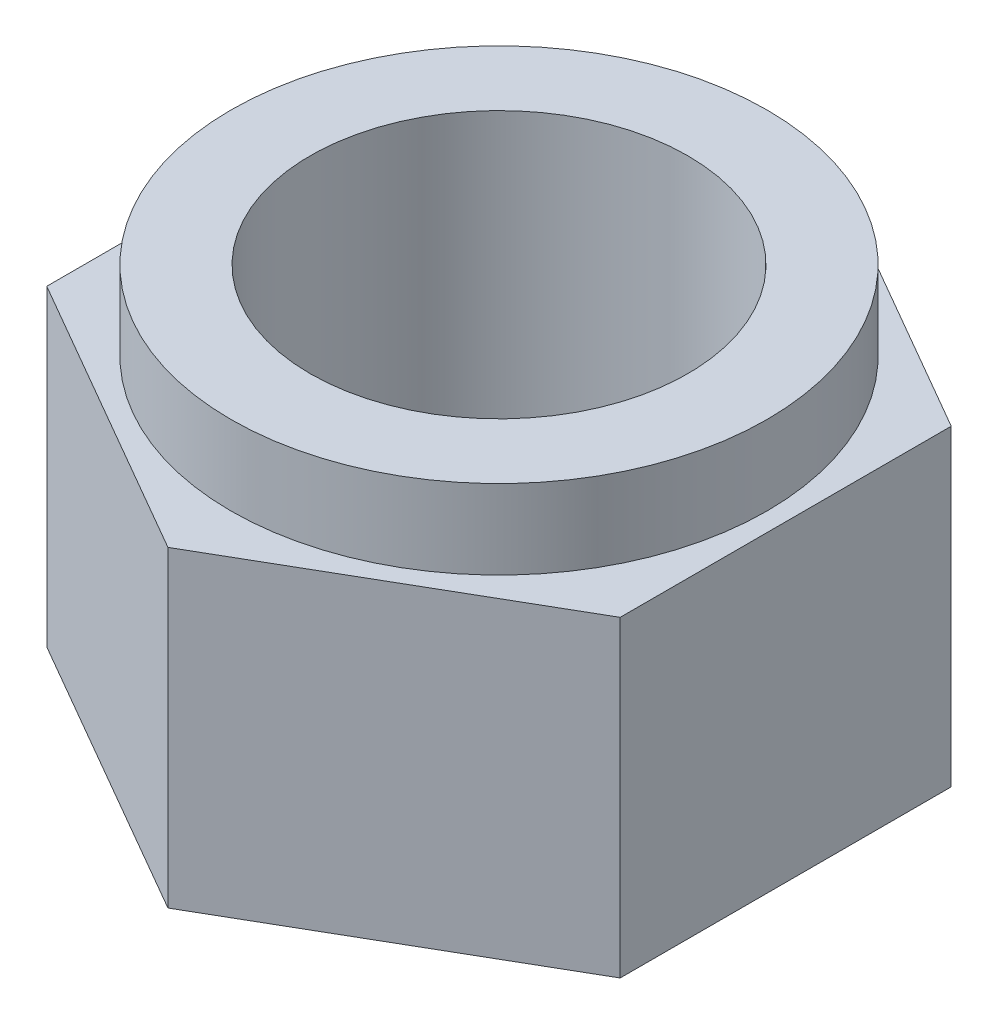
ISO-10303-21;
HEADER;
FILE_DESCRIPTION(('STEP AP214'),'2;1');
FILE_NAME('part.step','',(''),(''),'','','');
FILE_SCHEMA(('AUTOMOTIVE_DESIGN { 1 0 10303 214 1 1 1 1 }'));
ENDSEC;
DATA;
#1=APPLICATION_CONTEXT('core data for automotive mechanical design processes');
#2=APPLICATION_PROTOCOL_DEFINITION('international standard','automotive_design',2000,#1);
#3=PRODUCT_CONTEXT('',#1,'mechanical');
#4=PRODUCT('Part','Part','',(#3));
#5=PRODUCT_RELATED_PRODUCT_CATEGORY('part','',(#4));
#6=PRODUCT_DEFINITION_FORMATION('','',#4);
#7=PRODUCT_DEFINITION_CONTEXT('part definition',#1,'design');
#8=PRODUCT_DEFINITION('design','',#6,#7);
#9=PRODUCT_DEFINITION_SHAPE('','',#8);
#10=(LENGTH_UNIT() NAMED_UNIT(*) SI_UNIT(.MILLI.,.METRE.));
#11=(NAMED_UNIT(*) PLANE_ANGLE_UNIT() SI_UNIT($,.RADIAN.));
#12=(NAMED_UNIT(*) SI_UNIT($,.STERADIAN.) SOLID_ANGLE_UNIT());
#13=UNCERTAINTY_MEASURE_WITH_UNIT(LENGTH_MEASURE(1.E-05),#10,'distance_accuracy_value','');
#14=(GEOMETRIC_REPRESENTATION_CONTEXT(3) GLOBAL_UNCERTAINTY_ASSIGNED_CONTEXT((#13)) GLOBAL_UNIT_ASSIGNED_CONTEXT((#10,
#11,#12)) REPRESENTATION_CONTEXT('',''));
#15=CARTESIAN_POINT('',(0.,0.,0.));
#16=DIRECTION('',(0.,0.,1.));
#17=DIRECTION('',(1.,0.,0.));
#18=AXIS2_PLACEMENT_3D('',#15,#16,#17);
#19=CARTESIAN_POINT('',(0.,6.7,0.));
#20=DIRECTION('',(0.,1.,0.));
#21=DIRECTION('',(0.,0.,1.));
#22=AXIS2_PLACEMENT_3D('',#19,#20,#21);
#23=PLANE('',#22);
#24=CARTESIAN_POINT('',(-2.98261802575105,6.7,-3.02221030042916));
#25=DIRECTION('',(0.,1.,0.));
#26=DIRECTION('',(0.,0.,1.));
#27=AXIS2_PLACEMENT_3D('',#24,#25,#26);
#28=CIRCLE('',#27,5.75);
#29=CARTESIAN_POINT('',(-2.98261802575105,6.7,2.72778969957084));
#30=VERTEX_POINT('',#29);
#31=EDGE_CURVE('E11',#30,#30,#28,.T.);
#32=ORIENTED_EDGE('',*,*,#31,.F.);
#33=EDGE_LOOP('',(#32));
#34=FACE_BOUND('',#33,.T.);
#35=DIRECTION('',(0.866025403784438,0.,-0.5));
#36=VECTOR('',#35,1.);
#37=CARTESIAN_POINT('',(-2.98261802575105,6.7,4.07919801060324));
#38=LINE('',#37,#36);
#39=CARTESIAN_POINT('',(-2.98261802575105,6.7,4.07919801060324));
#40=VERTEX_POINT('',#39);
#41=CARTESIAN_POINT('',(3.16738197424895,6.7,0.528493855087039));
#42=VERTEX_POINT('',#41);
#43=EDGE_CURVE('E130',#40,#42,#38,.T.);
#44=ORIENTED_EDGE('',*,*,#43,.T.);
#45=DIRECTION('',(0.,0.,-1.));
#46=VECTOR('',#45,1.);
#47=CARTESIAN_POINT('',(3.16738197424895,6.7,0.528493855087039));
#48=LINE('',#47,#46);
#49=CARTESIAN_POINT('',(3.16738197424895,6.7,-6.57291445594536));
#50=VERTEX_POINT('',#49);
#51=EDGE_CURVE('E89',#42,#50,#48,.T.);
#52=ORIENTED_EDGE('',*,*,#51,.T.);
#53=DIRECTION('',(-0.866025403784439,0.,-0.5));
#54=VECTOR('',#53,1.);
#55=CARTESIAN_POINT('',(3.16738197424895,6.7,-6.57291445594536));
#56=LINE('',#55,#54);
#57=CARTESIAN_POINT('',(-2.98261802575105,6.7,-10.1236186114616));
#58=VERTEX_POINT('',#57);
#59=EDGE_CURVE('E101',#50,#58,#56,.T.);
#60=ORIENTED_EDGE('',*,*,#59,.T.);
#61=DIRECTION('',(-0.866025403784438,0.,0.5));
#62=VECTOR('',#61,1.);
#63=CARTESIAN_POINT('',(-2.98261802575105,6.7,-10.1236186114616));
#64=LINE('',#63,#62);
#65=CARTESIAN_POINT('',(-9.13261802575105,6.7,-6.57291445594536));
#66=VERTEX_POINT('',#65);
#67=EDGE_CURVE('E96',#58,#66,#64,.T.);
#68=ORIENTED_EDGE('',*,*,#67,.T.);
#69=DIRECTION('',(0.,0.,1.));
#70=VECTOR('',#69,1.);
#71=CARTESIAN_POINT('',(-9.13261802575105,6.7,-6.57291445594536));
#72=LINE('',#71,#70);
#73=CARTESIAN_POINT('',(-9.13261802575105,6.7,0.528493855087037));
#74=VERTEX_POINT('',#73);
#75=EDGE_CURVE('E99',#66,#74,#72,.T.);
#76=ORIENTED_EDGE('',*,*,#75,.T.);
#77=DIRECTION('',(0.866025403784439,0.,0.5));
#78=VECTOR('',#77,1.);
#79=CARTESIAN_POINT('',(-9.13261802575105,6.7,0.528493855087037));
#80=LINE('',#79,#78);
#81=EDGE_CURVE('E51',#74,#40,#80,.T.);
#82=ORIENTED_EDGE('',*,*,#81,.T.);
#83=EDGE_LOOP('',(#44,#52,#60,#68,#76,#82));
#84=FACE_BOUND('',#83,.T.);
#85=ADVANCED_FACE('F33',(#34,#84),#23,.T.);
#86=CARTESIAN_POINT('',(0.,0.,0.));
#87=DIRECTION('',(0.,1.,0.));
#88=DIRECTION('',(0.,0.,1.));
#89=AXIS2_PLACEMENT_3D('',#86,#87,#88);
#90=PLANE('',#89);
#91=DIRECTION('',(0.866025403784438,0.,-0.5));
#92=VECTOR('',#91,1.);
#93=CARTESIAN_POINT('',(-2.98261802575105,0.,4.07919801060324));
#94=LINE('',#93,#92);
#95=CARTESIAN_POINT('',(-2.98261802575105,0.,4.07919801060324));
#96=VERTEX_POINT('',#95);
#97=CARTESIAN_POINT('',(3.16738197424895,0.,0.528493855087039));
#98=VERTEX_POINT('',#97);
#99=EDGE_CURVE('E119',#96,#98,#94,.T.);
#100=ORIENTED_EDGE('',*,*,#99,.F.);
#101=DIRECTION('',(0.866025403784439,0.,0.5));
#102=VECTOR('',#101,1.);
#103=CARTESIAN_POINT('',(-9.13261802575105,0.,0.528493855087037));
#104=LINE('',#103,#102);
#105=CARTESIAN_POINT('',(-9.13261802575105,0.,0.528493855087037));
#106=VERTEX_POINT('',#105);
#107=EDGE_CURVE('E80',#106,#96,#104,.T.);
#108=ORIENTED_EDGE('',*,*,#107,.F.);
#109=DIRECTION('',(0.,0.,1.));
#110=VECTOR('',#109,1.);
#111=CARTESIAN_POINT('',(-9.13261802575105,0.,-6.57291445594536));
#112=LINE('',#111,#110);
#113=CARTESIAN_POINT('',(-9.13261802575105,0.,-6.57291445594536));
#114=VERTEX_POINT('',#113);
#115=EDGE_CURVE('E74',#114,#106,#112,.T.);
#116=ORIENTED_EDGE('',*,*,#115,.F.);
#117=DIRECTION('',(-0.866025403784438,0.,0.5));
#118=VECTOR('',#117,1.);
#119=CARTESIAN_POINT('',(-2.98261802575105,0.,-10.1236186114616));
#120=LINE('',#119,#118);
#121=CARTESIAN_POINT('',(-2.98261802575105,0.,-10.1236186114616));
#122=VERTEX_POINT('',#121);
#123=EDGE_CURVE('E109',#122,#114,#120,.T.);
#124=ORIENTED_EDGE('',*,*,#123,.F.);
#125=DIRECTION('',(-0.866025403784439,0.,-0.5));
#126=VECTOR('',#125,1.);
#127=CARTESIAN_POINT('',(3.16738197424895,0.,-6.57291445594536));
#128=LINE('',#127,#126);
#129=CARTESIAN_POINT('',(3.16738197424895,0.,-6.57291445594536));
#130=VERTEX_POINT('',#129);
#131=EDGE_CURVE('E125',#130,#122,#128,.T.);
#132=ORIENTED_EDGE('',*,*,#131,.F.);
#133=DIRECTION('',(0.,0.,-1.));
#134=VECTOR('',#133,1.);
#135=CARTESIAN_POINT('',(3.16738197424895,0.,0.528493855087039));
#136=LINE('',#135,#134);
#137=EDGE_CURVE('E122',#98,#130,#136,.T.);
#138=ORIENTED_EDGE('',*,*,#137,.F.);
#139=EDGE_LOOP('',(#100,#108,#116,#124,#132,#138));
#140=FACE_BOUND('',#139,.T.);
#141=CARTESIAN_POINT('',(-2.98261802575105,0.,-3.02221030042916));
#142=DIRECTION('',(0.,1.,0.));
#143=DIRECTION('',(0.,0.,1.));
#144=AXIS2_PLACEMENT_3D('',#141,#142,#143);
#145=CIRCLE('',#144,4.05);
#146=CARTESIAN_POINT('',(-2.98261802575105,0.,1.02778969957084));
#147=VERTEX_POINT('',#146);
#148=EDGE_CURVE('E123',#147,#147,#145,.T.);
#149=ORIENTED_EDGE('',*,*,#148,.T.);
#150=EDGE_LOOP('',(#149));
#151=FACE_BOUND('',#150,.T.);
#152=ADVANCED_FACE('F143',(#140,#151),#90,.F.);
#153=CARTESIAN_POINT('',(-2.98261802575105,6.7,4.07919801060324));
#154=DIRECTION('',(-0.5,0.,-0.866025403784438));
#155=DIRECTION('',(-0.866025403784439,0.,0.5));
#156=AXIS2_PLACEMENT_3D('',#153,#154,#155);
#157=PLANE('',#156);
#158=ORIENTED_EDGE('',*,*,#99,.T.);
#159=DIRECTION('',(0.,-1.,0.));
#160=VECTOR('',#159,1.);
#161=CARTESIAN_POINT('',(3.16738197424895,6.7,0.528493855087039));
#162=LINE('',#161,#160);
#163=EDGE_CURVE('E37',#42,#98,#162,.T.);
#164=ORIENTED_EDGE('',*,*,#163,.F.);
#165=ORIENTED_EDGE('',*,*,#43,.F.);
#166=DIRECTION('',(0.,-1.,0.));
#167=VECTOR('',#166,1.);
#168=CARTESIAN_POINT('',(-2.98261802575105,6.7,4.07919801060324));
#169=LINE('',#168,#167);
#170=EDGE_CURVE('E115',#40,#96,#169,.T.);
#171=ORIENTED_EDGE('',*,*,#170,.T.);
#172=EDGE_LOOP('',(#158,#164,#165,#171));
#173=FACE_BOUND('',#172,.T.);
#174=ADVANCED_FACE('F35',(#173),#157,.F.);
#175=CARTESIAN_POINT('',(3.16738197424895,6.7,0.528493855087039));
#176=DIRECTION('',(-1.,0.,0.));
#177=DIRECTION('',(0.,0.,1.));
#178=AXIS2_PLACEMENT_3D('',#175,#176,#177);
#179=PLANE('',#178);
#180=ORIENTED_EDGE('',*,*,#137,.T.);
#181=DIRECTION('',(0.,-1.,0.));
#182=VECTOR('',#181,1.);
#183=CARTESIAN_POINT('',(3.16738197424895,6.7,-6.57291445594536));
#184=LINE('',#183,#182);
#185=EDGE_CURVE('E133',#50,#130,#184,.T.);
#186=ORIENTED_EDGE('',*,*,#185,.F.);
#187=ORIENTED_EDGE('',*,*,#51,.F.);
#188=ORIENTED_EDGE('',*,*,#163,.T.);
#189=EDGE_LOOP('',(#180,#186,#187,#188));
#190=FACE_BOUND('',#189,.T.);
#191=ADVANCED_FACE('F138',(#190),#179,.F.);
#192=CARTESIAN_POINT('',(3.16738197424895,6.7,-6.57291445594536));
#193=DIRECTION('',(-0.5,0.,0.866025403784439));
#194=DIRECTION('',(0.866025403784439,0.,0.5));
#195=AXIS2_PLACEMENT_3D('',#192,#193,#194);
#196=PLANE('',#195);
#197=ORIENTED_EDGE('',*,*,#131,.T.);
#198=DIRECTION('',(0.,-1.,0.));
#199=VECTOR('',#198,1.);
#200=CARTESIAN_POINT('',(-2.98261802575105,6.7,-10.1236186114616));
#201=LINE('',#200,#199);
#202=EDGE_CURVE('E110',#58,#122,#201,.T.);
#203=ORIENTED_EDGE('',*,*,#202,.F.);
#204=ORIENTED_EDGE('',*,*,#59,.F.);
#205=ORIENTED_EDGE('',*,*,#185,.T.);
#206=EDGE_LOOP('',(#197,#203,#204,#205));
#207=FACE_BOUND('',#206,.T.);
#208=ADVANCED_FACE('F145',(#207),#196,.F.);
#209=CARTESIAN_POINT('',(-2.98261802575105,6.7,-10.1236186114616));
#210=DIRECTION('',(0.5,0.,0.866025403784438));
#211=DIRECTION('',(0.866025403784439,0.,-0.5));
#212=AXIS2_PLACEMENT_3D('',#209,#210,#211);
#213=PLANE('',#212);
#214=ORIENTED_EDGE('',*,*,#123,.T.);
#215=DIRECTION('',(0.,-1.,0.));
#216=VECTOR('',#215,1.);
#217=CARTESIAN_POINT('',(-9.13261802575105,6.7,-6.57291445594536));
#218=LINE('',#217,#216);
#219=EDGE_CURVE('E106',#66,#114,#218,.T.);
#220=ORIENTED_EDGE('',*,*,#219,.F.);
#221=ORIENTED_EDGE('',*,*,#67,.F.);
#222=ORIENTED_EDGE('',*,*,#202,.T.);
#223=EDGE_LOOP('',(#214,#220,#221,#222));
#224=FACE_BOUND('',#223,.T.);
#225=ADVANCED_FACE('F107',(#224),#213,.F.);
#226=CARTESIAN_POINT('',(-9.13261802575105,6.7,-6.57291445594536));
#227=DIRECTION('',(1.,0.,0.));
#228=DIRECTION('',(0.,0.,-1.));
#229=AXIS2_PLACEMENT_3D('',#226,#227,#228);
#230=PLANE('',#229);
#231=ORIENTED_EDGE('',*,*,#115,.T.);
#232=DIRECTION('',(0.,-1.,0.));
#233=VECTOR('',#232,1.);
#234=CARTESIAN_POINT('',(-9.13261802575105,6.7,0.528493855087037));
#235=LINE('',#234,#233);
#236=EDGE_CURVE('E111',#74,#106,#235,.T.);
#237=ORIENTED_EDGE('',*,*,#236,.F.);
#238=ORIENTED_EDGE('',*,*,#75,.F.);
#239=ORIENTED_EDGE('',*,*,#219,.T.);
#240=EDGE_LOOP('',(#231,#237,#238,#239));
#241=FACE_BOUND('',#240,.T.);
#242=ADVANCED_FACE('F113',(#241),#230,.F.);
#243=CARTESIAN_POINT('',(-9.13261802575105,6.7,0.528493855087037));
#244=DIRECTION('',(0.5,0.,-0.866025403784439));
#245=DIRECTION('',(-0.866025403784439,0.,-0.5));
#246=AXIS2_PLACEMENT_3D('',#243,#244,#245);
#247=PLANE('',#246);
#248=ORIENTED_EDGE('',*,*,#107,.T.);
#249=ORIENTED_EDGE('',*,*,#170,.F.);
#250=ORIENTED_EDGE('',*,*,#81,.F.);
#251=ORIENTED_EDGE('',*,*,#236,.T.);
#252=EDGE_LOOP('',(#248,#249,#250,#251));
#253=FACE_BOUND('',#252,.T.);
#254=ADVANCED_FACE('F171',(#253),#247,.F.);
#255=CARTESIAN_POINT('',(-2.98261802575105,6.7,-3.02221030042916));
#256=DIRECTION('',(0.,-1.,0.));
#257=DIRECTION('',(0.,0.,-1.));
#258=AXIS2_PLACEMENT_3D('',#255,#256,#257);
#259=CYLINDRICAL_SURFACE('',#258,4.05);
#260=ORIENTED_EDGE('',*,*,#148,.F.);
#261=EDGE_LOOP('',(#260));
#262=FACE_BOUND('',#261,.T.);
#263=CARTESIAN_POINT('',(-2.98261802575105,8.4,-3.02221030042916));
#264=DIRECTION('',(0.,1.,0.));
#265=DIRECTION('',(0.,0.,1.));
#266=AXIS2_PLACEMENT_3D('',#263,#264,#265);
#267=CIRCLE('',#266,4.05);
#268=CARTESIAN_POINT('',(-2.98261802575105,8.4,1.02778969957084));
#269=VERTEX_POINT('',#268);
#270=EDGE_CURVE('E154',#269,#269,#267,.T.);
#271=ORIENTED_EDGE('',*,*,#270,.T.);
#272=EDGE_LOOP('',(#271));
#273=FACE_BOUND('',#272,.T.);
#274=ADVANCED_FACE('F158',(#262,#273),#259,.F.);
#275=CARTESIAN_POINT('',(-2.98261802575105,8.4,-3.02221030042916));
#276=DIRECTION('',(0.,1.,0.));
#277=DIRECTION('',(0.,0.,1.));
#278=AXIS2_PLACEMENT_3D('',#275,#276,#277);
#279=PLANE('',#278);
#280=CARTESIAN_POINT('',(-2.98261802575105,8.4,-3.02221030042916));
#281=DIRECTION('',(0.,1.,0.));
#282=DIRECTION('',(0.,0.,1.));
#283=AXIS2_PLACEMENT_3D('',#280,#281,#282);
#284=CIRCLE('',#283,5.75);
#285=CARTESIAN_POINT('',(-2.98261802575105,8.4,2.72778969957084));
#286=VERTEX_POINT('',#285);
#287=EDGE_CURVE('E150',#286,#286,#284,.T.);
#288=ORIENTED_EDGE('',*,*,#287,.T.);
#289=EDGE_LOOP('',(#288));
#290=FACE_BOUND('',#289,.T.);
#291=ORIENTED_EDGE('',*,*,#270,.F.);
#292=EDGE_LOOP('',(#291));
#293=FACE_BOUND('',#292,.T.);
#294=ADVANCED_FACE('F160',(#290,#293),#279,.T.);
#295=CARTESIAN_POINT('',(-2.98261802575105,8.4,-3.02221030042916));
#296=DIRECTION('',(0.,-1.,0.));
#297=DIRECTION('',(0.,0.,-1.));
#298=AXIS2_PLACEMENT_3D('',#295,#296,#297);
#299=CYLINDRICAL_SURFACE('',#298,5.75);
#300=ORIENTED_EDGE('',*,*,#287,.F.);
#301=EDGE_LOOP('',(#300));
#302=FACE_BOUND('',#301,.T.);
#303=ORIENTED_EDGE('',*,*,#31,.T.);
#304=EDGE_LOOP('',(#303));
#305=FACE_BOUND('',#304,.T.);
#306=ADVANCED_FACE('F162',(#302,#305),#299,.T.);
#307=CLOSED_SHELL('',(#85,#152,#174,#191,#208,#225,#242,#254,#274,#294,#306));
#308=MANIFOLD_SOLID_BREP('B2',#307);
#309=ADVANCED_BREP_SHAPE_REPRESENTATION('',(#18,#308),#14);
#310=SHAPE_DEFINITION_REPRESENTATION(#9,#309);
ENDSEC;
END-ISO-10303-21;
